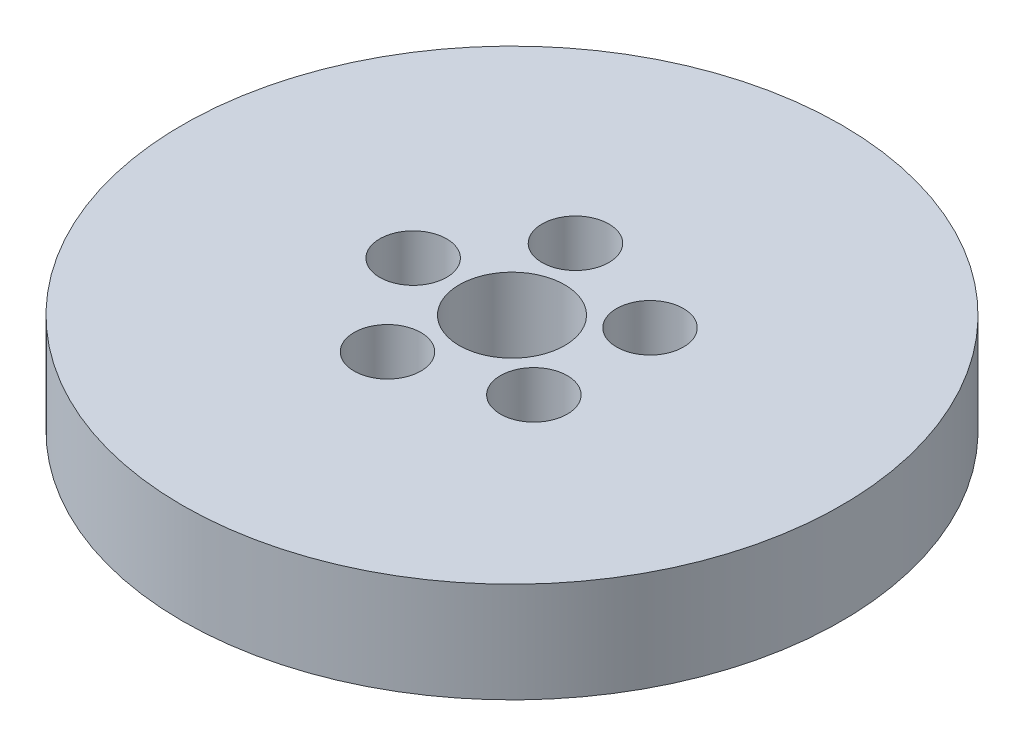
ISO-10303-21;
HEADER;
FILE_DESCRIPTION(('STEP AP214'),'2;1');
FILE_NAME('part.step','',(''),(''),'','','');
FILE_SCHEMA(('AUTOMOTIVE_DESIGN { 1 0 10303 214 1 1 1 1 }'));
ENDSEC;
DATA;
#1=APPLICATION_CONTEXT('core data for automotive mechanical design processes');
#2=APPLICATION_PROTOCOL_DEFINITION('international standard','automotive_design',2000,#1);
#3=PRODUCT_CONTEXT('',#1,'mechanical');
#4=PRODUCT('Part','Part','',(#3));
#5=PRODUCT_RELATED_PRODUCT_CATEGORY('part','',(#4));
#6=PRODUCT_DEFINITION_FORMATION('','',#4);
#7=PRODUCT_DEFINITION_CONTEXT('part definition',#1,'design');
#8=PRODUCT_DEFINITION('design','',#6,#7);
#9=PRODUCT_DEFINITION_SHAPE('','',#8);
#10=(LENGTH_UNIT() NAMED_UNIT(*) SI_UNIT(.MILLI.,.METRE.));
#11=(NAMED_UNIT(*) PLANE_ANGLE_UNIT() SI_UNIT($,.RADIAN.));
#12=(NAMED_UNIT(*) SI_UNIT($,.STERADIAN.) SOLID_ANGLE_UNIT());
#13=UNCERTAINTY_MEASURE_WITH_UNIT(LENGTH_MEASURE(1.E-05),#10,'distance_accuracy_value','');
#14=(GEOMETRIC_REPRESENTATION_CONTEXT(3) GLOBAL_UNCERTAINTY_ASSIGNED_CONTEXT((#13)) GLOBAL_UNIT_ASSIGNED_CONTEXT((#10,
#11,#12)) REPRESENTATION_CONTEXT('',''));
#15=CARTESIAN_POINT('',(0.,0.,0.));
#16=DIRECTION('',(0.,0.,1.));
#17=DIRECTION('',(1.,0.,0.));
#18=AXIS2_PLACEMENT_3D('',#15,#16,#17);
#19=CARTESIAN_POINT('',(0.,19.,0.));
#20=DIRECTION('',(0.,-1.,0.));
#21=DIRECTION('',(0.,0.,-1.));
#22=AXIS2_PLACEMENT_3D('',#19,#20,#21);
#23=CYLINDRICAL_SURFACE('',#22,62.5);
#24=CARTESIAN_POINT('',(0.,19.,0.));
#25=DIRECTION('',(0.,1.,0.));
#26=DIRECTION('',(0.,0.,1.));
#27=AXIS2_PLACEMENT_3D('',#24,#25,#26);
#28=CIRCLE('',#27,62.5);
#29=CARTESIAN_POINT('',(0.,19.,62.5));
#30=VERTEX_POINT('',#29);
#31=EDGE_CURVE('E10',#30,#30,#28,.T.);
#32=ORIENTED_EDGE('',*,*,#31,.F.);
#33=EDGE_LOOP('',(#32));
#34=FACE_BOUND('',#33,.T.);
#35=CARTESIAN_POINT('',(0.,0.,0.));
#36=DIRECTION('',(0.,1.,0.));
#37=DIRECTION('',(0.,0.,1.));
#38=AXIS2_PLACEMENT_3D('',#35,#36,#37);
#39=CIRCLE('',#38,62.5);
#40=CARTESIAN_POINT('',(0.,0.,62.5));
#41=VERTEX_POINT('',#40);
#42=EDGE_CURVE('E37',#41,#41,#39,.T.);
#43=ORIENTED_EDGE('',*,*,#42,.T.);
#44=EDGE_LOOP('',(#43));
#45=FACE_BOUND('',#44,.T.);
#46=ADVANCED_FACE('F40',(#34,#45),#23,.T.);
#47=CARTESIAN_POINT('',(0.,19.,0.));
#48=DIRECTION('',(0.,1.,0.));
#49=DIRECTION('',(0.,0.,1.));
#50=AXIS2_PLACEMENT_3D('',#47,#48,#49);
#51=PLANE('',#50);
#52=CARTESIAN_POINT('',(-5.79198525188242,19.,-17.8258976572797));
#53=DIRECTION('',(0.,1.,0.));
#54=DIRECTION('',(-0.95105651629515,0.,0.309016994374958));
#55=AXIS2_PLACEMENT_3D('',#52,#53,#54);
#56=CIRCLE('',#55,6.34035933833054);
#57=CARTESIAN_POINT('',(-11.8220253162545,19.,-15.8666188712916));
#58=VERTEX_POINT('',#57);
#59=EDGE_CURVE('E70',#58,#58,#56,.T.);
#60=ORIENTED_EDGE('',*,*,#59,.F.);
#61=EDGE_LOOP('',(#60));
#62=FACE_BOUND('',#61,.T.);
#63=CARTESIAN_POINT('',(15.1636142517657,19.,-11.0170106321762));
#64=DIRECTION('',(0.,1.,0.));
#65=DIRECTION('',(-0.58778525229248,0.,-0.809016994374942));
#66=AXIS2_PLACEMENT_3D('',#63,#64,#65);
#67=CIRCLE('',#66,6.34035933833054);
#68=CARTESIAN_POINT('',(11.4368445384601,19.,-16.1464690873294));
#69=VERTEX_POINT('',#68);
#70=EDGE_CURVE('E71',#69,#69,#67,.T.);
#71=ORIENTED_EDGE('',*,*,#70,.F.);
#72=EDGE_LOOP('',(#71));
#73=FACE_BOUND('',#72,.T.);
#74=CARTESIAN_POINT('',(15.1636142517658,19.,11.0170106321759));
#75=DIRECTION('',(0.,1.,0.));
#76=DIRECTION('',(0.587785252292469,0.,-0.809016994374951));
#77=AXIS2_PLACEMENT_3D('',#74,#75,#76);
#78=CIRCLE('',#77,6.34035933833054);
#79=CARTESIAN_POINT('',(18.8903839650714,19.,5.88755217702262));
#80=VERTEX_POINT('',#79);
#81=EDGE_CURVE('E78',#80,#80,#78,.T.);
#82=ORIENTED_EDGE('',*,*,#81,.F.);
#83=EDGE_LOOP('',(#82));
#84=FACE_BOUND('',#83,.T.);
#85=CARTESIAN_POINT('',(-5.79198525188217,19.,17.8258976572798));
#86=DIRECTION('',(0.,1.,0.));
#87=DIRECTION('',(0.951056516295155,0.,0.309016994374945));
#88=AXIS2_PLACEMENT_3D('',#85,#86,#87);
#89=CIRCLE('',#88,6.34035933833054);
#90=CARTESIAN_POINT('',(0.238054812489925,19.,19.7851764432678));
#91=VERTEX_POINT('',#90);
#92=EDGE_CURVE('E61',#91,#91,#89,.T.);
#93=ORIENTED_EDGE('',*,*,#92,.F.);
#94=EDGE_LOOP('',(#93));
#95=FACE_BOUND('',#94,.T.);
#96=CARTESIAN_POINT('',(-18.7432579997671,19.,0.));
#97=DIRECTION('',(0.,1.,0.));
#98=DIRECTION('',(0.,0.,1.));
#99=AXIS2_PLACEMENT_3D('',#96,#97,#98);
#100=CIRCLE('',#99,6.34035933833054);
#101=CARTESIAN_POINT('',(-18.7432579997671,19.,6.34035933833054));
#102=VERTEX_POINT('',#101);
#103=EDGE_CURVE('E54',#102,#102,#100,.T.);
#104=ORIENTED_EDGE('',*,*,#103,.F.);
#105=EDGE_LOOP('',(#104));
#106=FACE_BOUND('',#105,.T.);
#107=CARTESIAN_POINT('',(0.,19.,0.));
#108=DIRECTION('',(0.,1.,0.));
#109=DIRECTION('',(0.,0.,1.));
#110=AXIS2_PLACEMENT_3D('',#107,#108,#109);
#111=CIRCLE('',#110,10.);
#112=CARTESIAN_POINT('',(0.,19.,10.));
#113=VERTEX_POINT('',#112);
#114=EDGE_CURVE('E50',#113,#113,#111,.T.);
#115=ORIENTED_EDGE('',*,*,#114,.F.);
#116=EDGE_LOOP('',(#115));
#117=FACE_BOUND('',#116,.T.);
#118=ORIENTED_EDGE('',*,*,#31,.T.);
#119=EDGE_LOOP('',(#118));
#120=FACE_BOUND('',#119,.T.);
#121=ADVANCED_FACE('F94',(#62,#73,#84,#95,#106,#117,#120),#51,.T.);
#122=CARTESIAN_POINT('',(0.,0.,0.));
#123=DIRECTION('',(0.,1.,0.));
#124=DIRECTION('',(0.,0.,1.));
#125=AXIS2_PLACEMENT_3D('',#122,#123,#124);
#126=PLANE('',#125);
#127=CARTESIAN_POINT('',(0.,0.,0.));
#128=DIRECTION('',(0.,1.,0.));
#129=DIRECTION('',(0.,0.,1.));
#130=AXIS2_PLACEMENT_3D('',#127,#128,#129);
#131=CIRCLE('',#130,10.);
#132=CARTESIAN_POINT('',(0.,0.,10.));
#133=VERTEX_POINT('',#132);
#134=EDGE_CURVE('E47',#133,#133,#131,.T.);
#135=ORIENTED_EDGE('',*,*,#134,.T.);
#136=EDGE_LOOP('',(#135));
#137=FACE_BOUND('',#136,.T.);
#138=ORIENTED_EDGE('',*,*,#42,.F.);
#139=EDGE_LOOP('',(#138));
#140=FACE_BOUND('',#139,.T.);
#141=ADVANCED_FACE('F100',(#137,#140),#126,.F.);
#142=CARTESIAN_POINT('',(0.,19.,0.));
#143=DIRECTION('',(0.,-1.,0.));
#144=DIRECTION('',(0.,0.,-1.));
#145=AXIS2_PLACEMENT_3D('',#142,#143,#144);
#146=CYLINDRICAL_SURFACE('',#145,10.);
#147=ORIENTED_EDGE('',*,*,#114,.T.);
#148=EDGE_LOOP('',(#147));
#149=FACE_BOUND('',#148,.T.);
#150=ORIENTED_EDGE('',*,*,#134,.F.);
#151=EDGE_LOOP('',(#150));
#152=FACE_BOUND('',#151,.T.);
#153=ADVANCED_FACE('F106',(#149,#152),#146,.F.);
#154=CARTESIAN_POINT('',(-18.7432579997671,4.2038910454634,0.));
#155=DIRECTION('',(0.,1.,0.));
#156=DIRECTION('',(0.,0.,1.));
#157=AXIS2_PLACEMENT_3D('',#154,#155,#156);
#158=CYLINDRICAL_SURFACE('',#157,6.34035933833054);
#159=CARTESIAN_POINT('',(-18.7432579997671,4.2038910454634,0.));
#160=DIRECTION('',(0.,1.,0.));
#161=DIRECTION('',(0.,0.,1.));
#162=AXIS2_PLACEMENT_3D('',#159,#160,#161);
#163=CIRCLE('',#162,6.34035933833054);
#164=CARTESIAN_POINT('',(-18.7432579997671,4.2038910454634,6.34035933833054));
#165=VERTEX_POINT('',#164);
#166=EDGE_CURVE('E55',#165,#165,#163,.T.);
#167=ORIENTED_EDGE('',*,*,#166,.F.);
#168=EDGE_LOOP('',(#167));
#169=FACE_BOUND('',#168,.T.);
#170=ORIENTED_EDGE('',*,*,#103,.T.);
#171=EDGE_LOOP('',(#170));
#172=FACE_BOUND('',#171,.T.);
#173=ADVANCED_FACE('F108',(#169,#172),#158,.F.);
#174=CARTESIAN_POINT('',(-18.7432579997671,4.2038910454634,0.));
#175=DIRECTION('',(0.,1.,0.));
#176=DIRECTION('',(0.,0.,1.));
#177=AXIS2_PLACEMENT_3D('',#174,#175,#176);
#178=PLANE('',#177);
#179=ORIENTED_EDGE('',*,*,#166,.T.);
#180=EDGE_LOOP('',(#179));
#181=FACE_BOUND('',#180,.T.);
#182=ADVANCED_FACE('F138',(#181),#178,.T.);
#183=CARTESIAN_POINT('',(-5.79198525188217,4.2038910454634,17.8258976572798));
#184=DIRECTION('',(0.,1.,0.));
#185=DIRECTION('',(0.,0.,1.));
#186=AXIS2_PLACEMENT_3D('',#183,#184,#185);
#187=CYLINDRICAL_SURFACE('',#186,6.34035933833054);
#188=CARTESIAN_POINT('',(-5.79198525188217,4.2038910454634,17.8258976572798));
#189=DIRECTION('',(0.,1.,0.));
#190=DIRECTION('',(0.951056516295155,0.,0.309016994374945));
#191=AXIS2_PLACEMENT_3D('',#188,#189,#190);
#192=CIRCLE('',#191,6.34035933833054);
#193=CARTESIAN_POINT('',(0.238054812489925,4.2038910454634,19.7851764432678));
#194=VERTEX_POINT('',#193);
#195=EDGE_CURVE('E59',#194,#194,#192,.T.);
#196=ORIENTED_EDGE('',*,*,#195,.F.);
#197=EDGE_LOOP('',(#196));
#198=FACE_BOUND('',#197,.T.);
#199=ORIENTED_EDGE('',*,*,#92,.T.);
#200=EDGE_LOOP('',(#199));
#201=FACE_BOUND('',#200,.T.);
#202=ADVANCED_FACE('F150',(#198,#201),#187,.F.);
#203=CARTESIAN_POINT('',(-5.79198525188217,4.2038910454634,17.8258976572798));
#204=DIRECTION('',(0.,1.,0.));
#205=DIRECTION('',(0.951056516295155,0.,0.309016994374945));
#206=AXIS2_PLACEMENT_3D('',#203,#204,#205);
#207=PLANE('',#206);
#208=ORIENTED_EDGE('',*,*,#195,.T.);
#209=EDGE_LOOP('',(#208));
#210=FACE_BOUND('',#209,.T.);
#211=ADVANCED_FACE('F89',(#210),#207,.T.);
#212=CARTESIAN_POINT('',(15.1636142517658,4.2038910454634,11.0170106321759));
#213=DIRECTION('',(0.,1.,0.));
#214=DIRECTION('',(0.,0.,1.));
#215=AXIS2_PLACEMENT_3D('',#212,#213,#214);
#216=CYLINDRICAL_SURFACE('',#215,6.34035933833054);
#217=CARTESIAN_POINT('',(15.1636142517658,4.2038910454634,11.0170106321759));
#218=DIRECTION('',(0.,1.,0.));
#219=DIRECTION('',(0.587785252292469,0.,-0.809016994374951));
#220=AXIS2_PLACEMENT_3D('',#217,#218,#219);
#221=CIRCLE('',#220,6.34035933833054);
#222=CARTESIAN_POINT('',(18.8903839650714,4.2038910454634,5.88755217702262));
#223=VERTEX_POINT('',#222);
#224=EDGE_CURVE('E63',#223,#223,#221,.T.);
#225=ORIENTED_EDGE('',*,*,#224,.F.);
#226=EDGE_LOOP('',(#225));
#227=FACE_BOUND('',#226,.T.);
#228=ORIENTED_EDGE('',*,*,#81,.T.);
#229=EDGE_LOOP('',(#228));
#230=FACE_BOUND('',#229,.T.);
#231=ADVANCED_FACE('F87',(#227,#230),#216,.F.);
#232=CARTESIAN_POINT('',(15.1636142517658,4.2038910454634,11.0170106321759));
#233=DIRECTION('',(0.,1.,0.));
#234=DIRECTION('',(0.587785252292469,0.,-0.809016994374951));
#235=AXIS2_PLACEMENT_3D('',#232,#233,#234);
#236=PLANE('',#235);
#237=ORIENTED_EDGE('',*,*,#224,.T.);
#238=EDGE_LOOP('',(#237));
#239=FACE_BOUND('',#238,.T.);
#240=ADVANCED_FACE('F84',(#239),#236,.T.);
#241=CARTESIAN_POINT('',(15.1636142517657,4.2038910454634,-11.0170106321762));
#242=DIRECTION('',(0.,1.,0.));
#243=DIRECTION('',(0.,0.,1.));
#244=AXIS2_PLACEMENT_3D('',#241,#242,#243);
#245=CYLINDRICAL_SURFACE('',#244,6.34035933833054);
#246=CARTESIAN_POINT('',(15.1636142517657,4.2038910454634,-11.0170106321762));
#247=DIRECTION('',(0.,1.,0.));
#248=DIRECTION('',(-0.58778525229248,0.,-0.809016994374942));
#249=AXIS2_PLACEMENT_3D('',#246,#247,#248);
#250=CIRCLE('',#249,6.34035933833054);
#251=CARTESIAN_POINT('',(11.4368445384601,4.2038910454634,-16.1464690873294));
#252=VERTEX_POINT('',#251);
#253=EDGE_CURVE('E76',#252,#252,#250,.T.);
#254=ORIENTED_EDGE('',*,*,#253,.F.);
#255=EDGE_LOOP('',(#254));
#256=FACE_BOUND('',#255,.T.);
#257=ORIENTED_EDGE('',*,*,#70,.T.);
#258=EDGE_LOOP('',(#257));
#259=FACE_BOUND('',#258,.T.);
#260=ADVANCED_FACE('F185',(#256,#259),#245,.F.);
#261=CARTESIAN_POINT('',(15.1636142517657,4.2038910454634,-11.0170106321762));
#262=DIRECTION('',(0.,1.,0.));
#263=DIRECTION('',(-0.58778525229248,0.,-0.809016994374942));
#264=AXIS2_PLACEMENT_3D('',#261,#262,#263);
#265=PLANE('',#264);
#266=ORIENTED_EDGE('',*,*,#253,.T.);
#267=EDGE_LOOP('',(#266));
#268=FACE_BOUND('',#267,.T.);
#269=ADVANCED_FACE('F189',(#268),#265,.T.);
#270=CARTESIAN_POINT('',(-5.79198525188242,4.2038910454634,-17.8258976572797));
#271=DIRECTION('',(0.,1.,0.));
#272=DIRECTION('',(0.,0.,1.));
#273=AXIS2_PLACEMENT_3D('',#270,#271,#272);
#274=CYLINDRICAL_SURFACE('',#273,6.34035933833054);
#275=CARTESIAN_POINT('',(-5.79198525188242,4.2038910454634,-17.8258976572797));
#276=DIRECTION('',(0.,1.,0.));
#277=DIRECTION('',(-0.95105651629515,0.,0.309016994374958));
#278=AXIS2_PLACEMENT_3D('',#275,#276,#277);
#279=CIRCLE('',#278,6.34035933833054);
#280=CARTESIAN_POINT('',(-11.8220253162545,4.2038910454634,-15.8666188712916));
#281=VERTEX_POINT('',#280);
#282=EDGE_CURVE('E69',#281,#281,#279,.T.);
#283=ORIENTED_EDGE('',*,*,#282,.F.);
#284=EDGE_LOOP('',(#283));
#285=FACE_BOUND('',#284,.T.);
#286=ORIENTED_EDGE('',*,*,#59,.T.);
#287=EDGE_LOOP('',(#286));
#288=FACE_BOUND('',#287,.T.);
#289=ADVANCED_FACE('F200',(#285,#288),#274,.F.);
#290=CARTESIAN_POINT('',(-5.79198525188242,4.2038910454634,-17.8258976572797));
#291=DIRECTION('',(0.,1.,0.));
#292=DIRECTION('',(-0.95105651629515,0.,0.309016994374958));
#293=AXIS2_PLACEMENT_3D('',#290,#291,#292);
#294=PLANE('',#293);
#295=ORIENTED_EDGE('',*,*,#282,.T.);
#296=EDGE_LOOP('',(#295));
#297=FACE_BOUND('',#296,.T.);
#298=ADVANCED_FACE('F208',(#297),#294,.T.);
#299=CLOSED_SHELL('',(#46,#121,#141,#153,#173,#182,#202,#211,#231,#240,#260,#269,#289,#298));
#300=MANIFOLD_SOLID_BREP('B2',#299);
#301=ADVANCED_BREP_SHAPE_REPRESENTATION('',(#18,#300),#14);
#302=SHAPE_DEFINITION_REPRESENTATION(#9,#301);
ENDSEC;
END-ISO-10303-21;
